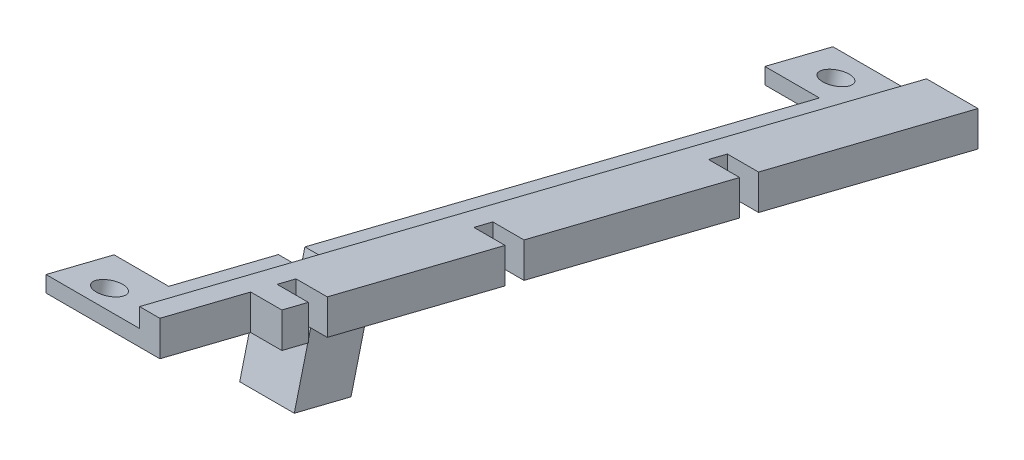
ISO-10303-21;
HEADER;
FILE_DESCRIPTION(('STEP AP214'),'2;1');
FILE_NAME('part.step','',(''),(''),'','','');
FILE_SCHEMA(('AUTOMOTIVE_DESIGN { 1 0 10303 214 1 1 1 1 }'));
ENDSEC;
DATA;
#1=APPLICATION_CONTEXT('core data for automotive mechanical design processes');
#2=APPLICATION_PROTOCOL_DEFINITION('international standard','automotive_design',2000,#1);
#3=PRODUCT_CONTEXT('',#1,'mechanical');
#4=PRODUCT('Part','Part','',(#3));
#5=PRODUCT_RELATED_PRODUCT_CATEGORY('part','',(#4));
#6=PRODUCT_DEFINITION_FORMATION('','',#4);
#7=PRODUCT_DEFINITION_CONTEXT('part definition',#1,'design');
#8=PRODUCT_DEFINITION('design','',#6,#7);
#9=PRODUCT_DEFINITION_SHAPE('','',#8);
#10=(LENGTH_UNIT() NAMED_UNIT(*) SI_UNIT(.MILLI.,.METRE.));
#11=(NAMED_UNIT(*) PLANE_ANGLE_UNIT() SI_UNIT($,.RADIAN.));
#12=(NAMED_UNIT(*) SI_UNIT($,.STERADIAN.) SOLID_ANGLE_UNIT());
#13=UNCERTAINTY_MEASURE_WITH_UNIT(LENGTH_MEASURE(1.E-05),#10,'distance_accuracy_value','');
#14=(GEOMETRIC_REPRESENTATION_CONTEXT(3) GLOBAL_UNCERTAINTY_ASSIGNED_CONTEXT((#13)) GLOBAL_UNIT_ASSIGNED_CONTEXT((#10,
#11,#12)) REPRESENTATION_CONTEXT('',''));
#15=CARTESIAN_POINT('',(0.,0.,0.));
#16=DIRECTION('',(0.,0.,1.));
#17=DIRECTION('',(1.,0.,0.));
#18=AXIS2_PLACEMENT_3D('',#15,#16,#17);
#19=CARTESIAN_POINT('',(4.,-4.23663208393258,1.05631101626826));
#20=DIRECTION('',(0.,0.970295726275996,-0.241921895599668));
#21=DIRECTION('',(0.,0.241921895599668,0.970295726275996));
#22=AXIS2_PLACEMENT_3D('',#19,#20,#21);
#23=PLANE('',#22);
#24=CARTESIAN_POINT('',(-9.85,-2.32302808125502,8.73135746454529));
#25=DIRECTION('',(0.,0.970295726275996,-0.241921895599668));
#26=DIRECTION('',(0.,0.241921895599668,0.970295726275996));
#27=AXIS2_PLACEMENT_3D('',#24,#25,#26);
#28=CIRCLE('',#27,1.75);
#29=CARTESIAN_POINT('',(-9.85,-1.8996647639556,10.4293749855283));
#30=VERTEX_POINT('',#29);
#31=EDGE_CURVE('E340',#30,#30,#28,.T.);
#32=ORIENTED_EDGE('',*,*,#31,.T.);
#33=EDGE_LOOP('',(#32));
#34=FACE_BOUND('',#33,.T.);
#35=CARTESIAN_POINT('',(-9.85,-25.5475300588232,-84.4170322579504));
#36=DIRECTION('',(0.,0.970295726275996,-0.241921895599668));
#37=DIRECTION('',(0.,0.241921895599668,0.970295726275996));
#38=AXIS2_PLACEMENT_3D('',#35,#36,#37);
#39=CIRCLE('',#38,1.75);
#40=CARTESIAN_POINT('',(-9.85,-25.1241667415238,-82.7190147369674));
#41=VERTEX_POINT('',#40);
#42=EDGE_CURVE('E347',#41,#41,#39,.T.);
#43=ORIENTED_EDGE('',*,*,#42,.T.);
#44=EDGE_LOOP('',(#43));
#45=FACE_BOUND('',#44,.T.);
#46=DIRECTION('',(1.,0.,0.));
#47=VECTOR('',#46,1.);
#48=CARTESIAN_POINT('',(-7.6,-8.49203641904656,-16.0111835554926));
#49=LINE('',#48,#47);
#50=CARTESIAN_POINT('',(-7.6,-8.49203641904656,-16.0111835554926));
#51=VERTEX_POINT('',#50);
#52=CARTESIAN_POINT('',(-0.6,-8.49203641904656,-16.0111835554926));
#53=VERTEX_POINT('',#52);
#54=EDGE_CURVE('E287',#51,#53,#49,.T.);
#55=ORIENTED_EDGE('',*,*,#54,.F.);
#56=DIRECTION('',(0.,0.241921895599668,0.970295726275996));
#57=VECTOR('',#56,1.);
#58=CARTESIAN_POINT('',(-7.6,-26.7568143951695,-89.2672068173917));
#59=LINE('',#58,#57);
#60=CARTESIAN_POINT('',(-7.6,-24.5795173347725,-80.5345452809077));
#61=VERTEX_POINT('',#60);
#62=EDGE_CURVE('E256',#61,#51,#59,.T.);
#63=ORIENTED_EDGE('',*,*,#62,.F.);
#64=DIRECTION('',(1.,0.,0.));
#65=VECTOR('',#64,1.);
#66=CARTESIAN_POINT('',(-14.6,-24.5795173347725,-80.5345452809077));
#67=LINE('',#66,#65);
#68=CARTESIAN_POINT('',(-14.6,-24.5795173347725,-80.5345452809077));
#69=VERTEX_POINT('',#68);
#70=EDGE_CURVE('E398',#69,#61,#67,.T.);
#71=ORIENTED_EDGE('',*,*,#70,.F.);
#72=DIRECTION('',(0.,0.241921895599668,0.970295726275996));
#73=VECTOR('',#72,1.);
#74=CARTESIAN_POINT('',(-14.6,-24.5795173347725,-80.5345452809077));
#75=LINE('',#74,#73);
#76=CARTESIAN_POINT('',(-14.6,-26.7568143951695,-89.2672068173917));
#77=VERTEX_POINT('',#76);
#78=EDGE_CURVE('E381',#77,#69,#75,.T.);
#79=ORIENTED_EDGE('',*,*,#78,.F.);
#80=DIRECTION('',(1.,0.,0.));
#81=VECTOR('',#80,1.);
#82=CARTESIAN_POINT('',(-2.6,-26.7568143951695,-89.2672068173917));
#83=LINE('',#82,#81);
#84=CARTESIAN_POINT('',(4.,-26.7568143951695,-89.2672068173917));
#85=VERTEX_POINT('',#84);
#86=EDGE_CURVE('E551',#77,#85,#83,.T.);
#87=ORIENTED_EDGE('',*,*,#86,.T.);
#88=DIRECTION('',(0.,-0.241921895599668,-0.970295726275996));
#89=VECTOR('',#88,1.);
#90=CARTESIAN_POINT('',(4.,-4.23663208393258,1.05631101626826));
#91=LINE('',#90,#89);
#92=CARTESIAN_POINT('',(4.,-19.7410794227791,-61.1286307553878));
#93=VERTEX_POINT('',#92);
#94=EDGE_CURVE('E427',#93,#85,#91,.T.);
#95=ORIENTED_EDGE('',*,*,#94,.F.);
#96=DIRECTION('',(-1.,0.,0.));
#97=VECTOR('',#96,1.);
#98=CARTESIAN_POINT('',(4.,-19.7410794227791,-61.1286307553878));
#99=LINE('',#98,#97);
#100=CARTESIAN_POINT('',(0.,-19.7410794227791,-61.1286307553878));
#101=VERTEX_POINT('',#100);
#102=EDGE_CURVE('E445',#93,#101,#99,.T.);
#103=ORIENTED_EDGE('',*,*,#102,.T.);
#104=DIRECTION('',(0.,0.241921895599668,0.970295726275996));
#105=VECTOR('',#104,1.);
#106=CARTESIAN_POINT('',(0.,-26.7568143951695,-89.2672068173917));
#107=LINE('',#106,#105);
#108=CARTESIAN_POINT('',(0.,-19.1362746837799,-58.7028914396978));
#109=VERTEX_POINT('',#108);
#110=EDGE_CURVE('E538',#101,#109,#107,.T.);
#111=ORIENTED_EDGE('',*,*,#110,.T.);
#112=DIRECTION('',(-1.,0.,0.));
#113=VECTOR('',#112,1.);
#114=CARTESIAN_POINT('',(4.,-19.1362746837799,-58.7028914396978));
#115=LINE('',#114,#113);
#116=CARTESIAN_POINT('',(4.,-19.1362746837799,-58.7028914396978));
#117=VERTEX_POINT('',#116);
#118=EDGE_CURVE('E476',#117,#109,#115,.T.);
#119=ORIENTED_EDGE('',*,*,#118,.F.);
#120=DIRECTION('',(0.,-0.241921895599668,-0.970295726275996));
#121=VECTOR('',#120,1.);
#122=CARTESIAN_POINT('',(4.,-4.23663208393258,1.05631101626826));
#123=LINE('',#122,#121);
#124=CARTESIAN_POINT('',(4.,-12.2415006591894,-31.0494632408319));
#125=VERTEX_POINT('',#124);
#126=EDGE_CURVE('E453',#125,#117,#123,.T.);
#127=ORIENTED_EDGE('',*,*,#126,.F.);
#128=DIRECTION('',(-1.,0.,0.));
#129=VECTOR('',#128,1.);
#130=CARTESIAN_POINT('',(4.,-12.2415006591894,-31.0494632408319));
#131=LINE('',#130,#129);
#132=CARTESIAN_POINT('',(0.,-12.2415006591894,-31.0494632408319));
#133=VERTEX_POINT('',#132);
#134=EDGE_CURVE('E480',#125,#133,#131,.T.);
#135=ORIENTED_EDGE('',*,*,#134,.T.);
#136=CARTESIAN_POINT('',(0.,-11.6366959201902,-28.6237239251419));
#137=VERTEX_POINT('',#136);
#138=EDGE_CURVE('E541',#133,#137,#107,.T.);
#139=ORIENTED_EDGE('',*,*,#138,.T.);
#140=DIRECTION('',(-1.,0.,0.));
#141=VECTOR('',#140,1.);
#142=CARTESIAN_POINT('',(4.,-11.6366959201902,-28.6237239251419));
#143=LINE('',#142,#141);
#144=CARTESIAN_POINT('',(4.,-11.6366959201902,-28.6237239251419));
#145=VERTEX_POINT('',#144);
#146=EDGE_CURVE('E511',#145,#137,#143,.T.);
#147=ORIENTED_EDGE('',*,*,#146,.F.);
#148=DIRECTION('',(0.,-0.241921895599668,-0.970295726275996));
#149=VECTOR('',#148,1.);
#150=CARTESIAN_POINT('',(4.,-4.23663208393258,1.05631101626826));
#151=LINE('',#150,#149);
#152=CARTESIAN_POINT('',(4.,-5.95153137359801,-5.82177435765599));
#153=VERTEX_POINT('',#152);
#154=EDGE_CURVE('E488',#153,#145,#151,.T.);
#155=ORIENTED_EDGE('',*,*,#154,.F.);
#156=DIRECTION('',(-1.,0.,0.));
#157=VECTOR('',#156,1.);
#158=CARTESIAN_POINT('',(4.,-5.95153137359801,-5.82177435765599));
#159=LINE('',#158,#157);
#160=CARTESIAN_POINT('',(0.,-5.95153137359801,-5.82177435765599));
#161=VERTEX_POINT('',#160);
#162=EDGE_CURVE('E515',#153,#161,#159,.T.);
#163=ORIENTED_EDGE('',*,*,#162,.T.);
#164=CARTESIAN_POINT('',(0.,-5.34672663459884,-3.39603504196599));
#165=VERTEX_POINT('',#164);
#166=EDGE_CURVE('E600',#161,#165,#107,.T.);
#167=ORIENTED_EDGE('',*,*,#166,.T.);
#168=DIRECTION('',(-1.,0.,0.));
#169=VECTOR('',#168,1.);
#170=CARTESIAN_POINT('',(4.,-5.34672663459884,-3.39603504196599));
#171=LINE('',#170,#169);
#172=CARTESIAN_POINT('',(4.,-5.34672663459884,-3.39603504196599));
#173=VERTEX_POINT('',#172);
#174=EDGE_CURVE('E11',#173,#165,#171,.T.);
#175=ORIENTED_EDGE('',*,*,#174,.F.);
#176=DIRECTION('',(0.,-0.241921895599668,-0.970295726275996));
#177=VECTOR('',#176,1.);
#178=CARTESIAN_POINT('',(4.,-4.23663208393258,1.05631101626826));
#179=LINE('',#178,#177);
#180=CARTESIAN_POINT('',(4.,-4.5,0.));
#181=VERTEX_POINT('',#180);
#182=EDGE_CURVE('E558',#181,#173,#179,.T.);
#183=ORIENTED_EDGE('',*,*,#182,.F.);
#184=DIRECTION('',(-1.,0.,0.));
#185=VECTOR('',#184,1.);
#186=CARTESIAN_POINT('',(4.,-4.5,0.));
#187=LINE('',#186,#185);
#188=CARTESIAN_POINT('',(0.,-4.5,0.));
#189=VERTEX_POINT('',#188);
#190=EDGE_CURVE('E573',#181,#189,#187,.T.);
#191=ORIENTED_EDGE('',*,*,#190,.T.);
#192=CARTESIAN_POINT('',(0.,-1.59693725280398,11.643548715312));
#193=VERTEX_POINT('',#192);
#194=EDGE_CURVE('E536',#189,#193,#107,.T.);
#195=ORIENTED_EDGE('',*,*,#194,.T.);
#196=DIRECTION('',(1.,0.,0.));
#197=VECTOR('',#196,1.);
#198=CARTESIAN_POINT('',(-2.6,-1.59693725280398,11.643548715312));
#199=LINE('',#198,#197);
#200=CARTESIAN_POINT('',(-14.6,-1.59693725280398,11.643548715312));
#201=VERTEX_POINT('',#200);
#202=EDGE_CURVE('E547',#201,#193,#199,.T.);
#203=ORIENTED_EDGE('',*,*,#202,.F.);
#204=DIRECTION('',(0.,0.241921895599669,0.970295726275996));
#205=VECTOR('',#204,1.);
#206=CARTESIAN_POINT('',(-14.6,-1.59693725280398,11.643548715312));
#207=LINE('',#206,#205);
#208=CARTESIAN_POINT('',(-14.6,-3.774234313201,2.91088717882799));
#209=VERTEX_POINT('',#208);
#210=EDGE_CURVE('E358',#209,#201,#207,.T.);
#211=ORIENTED_EDGE('',*,*,#210,.F.);
#212=DIRECTION('',(1.,0.,0.));
#213=VECTOR('',#212,1.);
#214=CARTESIAN_POINT('',(-14.6,-3.774234313201,2.91088717882799));
#215=LINE('',#214,#213);
#216=CARTESIAN_POINT('',(-7.6,-3.774234313201,2.91088717882798));
#217=VERTEX_POINT('',#216);
#218=EDGE_CURVE('E366',#209,#217,#215,.T.);
#219=ORIENTED_EDGE('',*,*,#218,.T.);
#220=CARTESIAN_POINT('',(-7.6,-6.67762220204905,-8.73396560842266));
#221=VERTEX_POINT('',#220);
#222=EDGE_CURVE('E406',#221,#217,#59,.T.);
#223=ORIENTED_EDGE('',*,*,#222,.F.);
#224=DIRECTION('',(-1.,0.,0.));
#225=VECTOR('',#224,1.);
#226=CARTESIAN_POINT('',(-0.6,-6.67762220204905,-8.73396560842266));
#227=LINE('',#226,#225);
#228=CARTESIAN_POINT('',(-0.6,-6.67762220204905,-8.73396560842266));
#229=VERTEX_POINT('',#228);
#230=EDGE_CURVE('E294',#229,#221,#227,.T.);
#231=ORIENTED_EDGE('',*,*,#230,.F.);
#232=DIRECTION('',(0.,0.241921895599668,0.970295726275996));
#233=VECTOR('',#232,1.);
#234=CARTESIAN_POINT('',(-0.6,-6.67762220204905,-8.73396560842266));
#235=LINE('',#234,#233);
#236=EDGE_CURVE('E305',#53,#229,#235,.T.);
#237=ORIENTED_EDGE('',*,*,#236,.F.);
#238=EDGE_LOOP('',(#55,#63,#71,#79,#87,#95,#103,#111,#119,#127,#135,#139,#147,#155,#163,#167,
#175,#183,#191,#195,#203,#211,#219,#223,#231,#237));
#239=FACE_BOUND('',#238,.T.);
#240=ADVANCED_FACE('F39',(#34,#45,#239),#23,.F.);
#241=CARTESIAN_POINT('',(-7.6,-24.6955871364697,-89.2672068173917));
#242=DIRECTION('',(0.,-0.970295726275996,0.241921895599668));
#243=DIRECTION('',(0.,-0.241921895599668,-0.970295726275996));
#244=AXIS2_PLACEMENT_3D('',#241,#242,#243);
#245=PLANE('',#244);
#246=CARTESIAN_POINT('',(-9.85,-0.382436628703028,8.24751367334595));
#247=DIRECTION('',(0.,0.970295726275996,-0.241921895599668));
#248=DIRECTION('',(0.,0.241921895599668,0.970295726275996));
#249=AXIS2_PLACEMENT_3D('',#246,#247,#248);
#250=CIRCLE('',#249,1.75);
#251=CARTESIAN_POINT('',(-9.85,0.0409266885963917,9.94553119432895));
#252=VERTEX_POINT('',#251);
#253=EDGE_CURVE('E328',#252,#252,#250,.T.);
#254=ORIENTED_EDGE('',*,*,#253,.F.);
#255=EDGE_LOOP('',(#254));
#256=FACE_BOUND('',#255,.T.);
#257=DIRECTION('',(0.,-0.241921895599668,-0.970295726275996));
#258=VECTOR('',#257,1.);
#259=CARTESIAN_POINT('',(-2.6,-24.6955871364697,-89.2672068173917));
#260=LINE('',#259,#258);
#261=CARTESIAN_POINT('',(-2.6,0.464290005895813,11.643548715312));
#262=VERTEX_POINT('',#261);
#263=CARTESIAN_POINT('',(-2.6,-5.2208745406964,-11.158400852174));
#264=VERTEX_POINT('',#263);
#265=EDGE_CURVE('E411',#262,#264,#260,.T.);
#266=ORIENTED_EDGE('',*,*,#265,.T.);
#267=DIRECTION('',(-1.,0.,0.));
#268=VECTOR('',#267,1.);
#269=CARTESIAN_POINT('',(-2.6,-5.2208745406964,-11.158400852174));
#270=LINE('',#269,#268);
#271=CARTESIAN_POINT('',(-7.6,-5.2208745406964,-11.158400852174));
#272=VERTEX_POINT('',#271);
#273=EDGE_CURVE('E260',#264,#272,#270,.T.);
#274=ORIENTED_EDGE('',*,*,#273,.T.);
#275=DIRECTION('',(0.,-0.241921895599668,-0.970295726275996));
#276=VECTOR('',#275,1.);
#277=CARTESIAN_POINT('',(-7.6,-24.6955871364697,-89.2672068173917));
#278=LINE('',#277,#276);
#279=CARTESIAN_POINT('',(-7.6,-1.7130070545012,2.91088717882799));
#280=VERTEX_POINT('',#279);
#281=EDGE_CURVE('E407',#280,#272,#278,.T.);
#282=ORIENTED_EDGE('',*,*,#281,.F.);
#283=DIRECTION('',(1.,0.,0.));
#284=VECTOR('',#283,1.);
#285=CARTESIAN_POINT('',(-14.6,-1.7130070545012,2.91088717882799));
#286=LINE('',#285,#284);
#287=CARTESIAN_POINT('',(-14.6,-1.7130070545012,2.91088717882799));
#288=VERTEX_POINT('',#287);
#289=EDGE_CURVE('E372',#288,#280,#286,.T.);
#290=ORIENTED_EDGE('',*,*,#289,.F.);
#291=DIRECTION('',(0.,-0.241921895599668,-0.970295726275996));
#292=VECTOR('',#291,1.);
#293=CARTESIAN_POINT('',(-14.6,-1.7130070545012,2.91088717882799));
#294=LINE('',#293,#292);
#295=CARTESIAN_POINT('',(-14.6,0.464290005895813,11.643548715312));
#296=VERTEX_POINT('',#295);
#297=EDGE_CURVE('E351',#296,#288,#294,.T.);
#298=ORIENTED_EDGE('',*,*,#297,.F.);
#299=DIRECTION('',(1.,0.,0.));
#300=VECTOR('',#299,1.);
#301=CARTESIAN_POINT('',(-7.6,0.464290005895813,11.643548715312));
#302=LINE('',#301,#300);
#303=EDGE_CURVE('E418',#296,#262,#302,.T.);
#304=ORIENTED_EDGE('',*,*,#303,.T.);
#305=EDGE_LOOP('',(#266,#274,#282,#290,#298,#304));
#306=FACE_BOUND('',#305,.T.);
#307=ADVANCED_FACE('F658',(#256,#306),#245,.F.);
#308=CARTESIAN_POINT('',(-7.6,0.,0.));
#309=DIRECTION('',(-1.,0.,0.));
#310=DIRECTION('',(0.,0.,1.));
#311=AXIS2_PLACEMENT_3D('',#308,#309,#310);
#312=PLANE('',#311);
#313=DIRECTION('',(0.,-0.970295726275996,0.241921895599668));
#314=VECTOR('',#313,1.);
#315=CARTESIAN_POINT('',(-7.6,-6.06760117529524,-14.55443589414));
#316=LINE('',#315,#314);
#317=CARTESIAN_POINT('',(-7.6,-6.06760117529524,-14.55443589414));
#318=VERTEX_POINT('',#317);
#319=CARTESIAN_POINT('',(-7.6,-16.2557063011932,-12.0142559903435));
#320=VERTEX_POINT('',#319);
#321=EDGE_CURVE('E331',#318,#320,#316,.T.);
#322=ORIENTED_EDGE('',*,*,#321,.F.);
#323=CARTESIAN_POINT('',(-7.6,-22.5182900760727,-80.5345452809077));
#324=VERTEX_POINT('',#323);
#325=EDGE_CURVE('E405',#318,#324,#278,.T.);
#326=ORIENTED_EDGE('',*,*,#325,.T.);
#327=DIRECTION('',(0.,1.,0.));
#328=VECTOR('',#327,1.);
#329=CARTESIAN_POINT('',(-7.6,-22.5182900760727,-80.5345452809077));
#330=LINE('',#329,#328);
#331=EDGE_CURVE('E376',#61,#324,#330,.T.);
#332=ORIENTED_EDGE('',*,*,#331,.F.);
#333=ORIENTED_EDGE('',*,*,#62,.T.);
#334=DIRECTION('',(0.,0.970295726275996,-0.241921895599668));
#335=VECTOR('',#334,1.);
#336=CARTESIAN_POINT('',(-7.6,-16.7395500923925,-13.9548474428954));
#337=LINE('',#336,#335);
#338=CARTESIAN_POINT('',(-7.6,-18.6801415449445,-13.4710036516961));
#339=VERTEX_POINT('',#338);
#340=EDGE_CURVE('E248',#339,#51,#337,.T.);
#341=ORIENTED_EDGE('',*,*,#340,.F.);
#342=DIRECTION('',(0.,-0.241921895599669,-0.970295726275996));
#343=VECTOR('',#342,1.);
#344=CARTESIAN_POINT('',(-7.6,-16.865727327947,-6.19378570462615));
#345=LINE('',#344,#343);
#346=CARTESIAN_POINT('',(-7.6,-16.865727327947,-6.19378570462615));
#347=VERTEX_POINT('',#346);
#348=EDGE_CURVE('E254',#347,#339,#345,.T.);
#349=ORIENTED_EDGE('',*,*,#348,.F.);
#350=DIRECTION('',(0.,0.970295726275996,-0.241921895599668));
#351=VECTOR('',#350,1.);
#352=CARTESIAN_POINT('',(-7.6,-14.925135875395,-6.67762949582548));
#353=LINE('',#352,#351);
#354=EDGE_CURVE('E302',#347,#221,#353,.T.);
#355=ORIENTED_EDGE('',*,*,#354,.T.);
#356=ORIENTED_EDGE('',*,*,#222,.T.);
#357=DIRECTION('',(0.,-1.,0.));
#358=VECTOR('',#357,1.);
#359=CARTESIAN_POINT('',(-7.6,-3.774234313201,2.91088717882799));
#360=LINE('',#359,#358);
#361=EDGE_CURVE('E62',#280,#217,#360,.T.);
#362=ORIENTED_EDGE('',*,*,#361,.F.);
#363=ORIENTED_EDGE('',*,*,#281,.T.);
#364=DIRECTION('',(0.,-0.970295726275996,0.241921895599668));
#365=VECTOR('',#364,1.);
#366=CARTESIAN_POINT('',(-7.6,-5.2208745406964,-11.158400852174));
#367=LINE('',#366,#365);
#368=CARTESIAN_POINT('',(-7.6,-15.4089796665944,-8.61822094837747));
#369=VERTEX_POINT('',#368);
#370=EDGE_CURVE('E324',#272,#369,#367,.T.);
#371=ORIENTED_EDGE('',*,*,#370,.T.);
#372=DIRECTION('',(0.,-0.241921895599669,-0.970295726275996));
#373=VECTOR('',#372,1.);
#374=CARTESIAN_POINT('',(-7.6,-14.925135875395,-6.67762949582548));
#375=LINE('',#374,#373);
#376=EDGE_CURVE('E278',#369,#320,#375,.T.);
#377=ORIENTED_EDGE('',*,*,#376,.T.);
#378=EDGE_LOOP('',(#322,#326,#332,#333,#341,#349,#355,#356,#362,#363,#371,#377));
#379=FACE_BOUND('',#378,.T.);
#380=ADVANCED_FACE('F251',(#379),#312,.T.);
#381=CARTESIAN_POINT('',(-2.6,0.,0.));
#382=DIRECTION('',(1.,0.,0.));
#383=DIRECTION('',(0.,0.,-1.));
#384=AXIS2_PLACEMENT_3D('',#381,#382,#383);
#385=PLANE('',#384);
#386=ORIENTED_EDGE('',*,*,#265,.F.);
#387=DIRECTION('',(0.,1.,0.));
#388=VECTOR('',#387,1.);
#389=CARTESIAN_POINT('',(-2.6,2.90306274719602,11.643548715312));
#390=LINE('',#389,#388);
#391=CARTESIAN_POINT('',(-2.6,2.90306274719602,11.643548715312));
#392=VERTEX_POINT('',#391);
#393=EDGE_CURVE('E528',#262,#392,#390,.T.);
#394=ORIENTED_EDGE('',*,*,#393,.T.);
#395=DIRECTION('',(0.,-0.241921895599668,-0.970295726275996));
#396=VECTOR('',#395,1.);
#397=CARTESIAN_POINT('',(-2.6,-22.2568143951695,-89.2672068173917));
#398=LINE('',#397,#396);
#399=CARTESIAN_POINT('',(-2.6,-22.2568143951695,-89.2672068173917));
#400=VERTEX_POINT('',#399);
#401=EDGE_CURVE('E519',#392,#400,#398,.T.);
#402=ORIENTED_EDGE('',*,*,#401,.T.);
#403=DIRECTION('',(0.,-1.,0.));
#404=VECTOR('',#403,1.);
#405=CARTESIAN_POINT('',(-2.6,-22.2568143951695,-89.2672068173917));
#406=LINE('',#405,#404);
#407=CARTESIAN_POINT('',(-2.6,-24.6955871364697,-89.2672068173917));
#408=VERTEX_POINT('',#407);
#409=EDGE_CURVE('E523',#400,#408,#406,.T.);
#410=ORIENTED_EDGE('',*,*,#409,.T.);
#411=CARTESIAN_POINT('',(-2.6,-6.06760117529523,-14.55443589414));
#412=VERTEX_POINT('',#411);
#413=EDGE_CURVE('E402',#412,#408,#260,.T.);
#414=ORIENTED_EDGE('',*,*,#413,.F.);
#415=DIRECTION('',(0.,-0.970295726275996,0.241921895599668));
#416=VECTOR('',#415,1.);
#417=CARTESIAN_POINT('',(-2.6,-6.06760117529524,-14.55443589414));
#418=LINE('',#417,#416);
#419=CARTESIAN_POINT('',(-2.6,-16.2557063011932,-12.0142559903435));
#420=VERTEX_POINT('',#419);
#421=EDGE_CURVE('E54',#412,#420,#418,.T.);
#422=ORIENTED_EDGE('',*,*,#421,.T.);
#423=DIRECTION('',(0.,-0.241921895599668,-0.970295726275996));
#424=VECTOR('',#423,1.);
#425=CARTESIAN_POINT('',(-2.6,-16.2557063011932,-12.0142559903435));
#426=LINE('',#425,#424);
#427=CARTESIAN_POINT('',(-2.6,-15.4089796665944,-8.61822094837747));
#428=VERTEX_POINT('',#427);
#429=EDGE_CURVE('E289',#428,#420,#426,.T.);
#430=ORIENTED_EDGE('',*,*,#429,.F.);
#431=DIRECTION('',(0.,-0.970295726275996,0.241921895599668));
#432=VECTOR('',#431,1.);
#433=CARTESIAN_POINT('',(-2.6,-5.2208745406964,-11.158400852174));
#434=LINE('',#433,#432);
#435=EDGE_CURVE('E325',#264,#428,#434,.T.);
#436=ORIENTED_EDGE('',*,*,#435,.F.);
#437=EDGE_LOOP('',(#386,#394,#402,#410,#414,#422,#430,#436));
#438=FACE_BOUND('',#437,.T.);
#439=ADVANCED_FACE('F631',(#438),#385,.F.);
#440=CARTESIAN_POINT('',(0.,0.,0.));
#441=DIRECTION('',(1.,0.,0.));
#442=DIRECTION('',(0.,0.,-1.));
#443=AXIS2_PLACEMENT_3D('',#440,#441,#442);
#444=PLANE('',#443);
#445=DIRECTION('',(0.,1.,0.));
#446=VECTOR('',#445,1.);
#447=CARTESIAN_POINT('',(0.,0.,-61.1286307553878));
#448=LINE('',#447,#446);
#449=CARTESIAN_POINT('',(0.,-15.2410794227791,-61.1286307553878));
#450=VERTEX_POINT('',#449);
#451=EDGE_CURVE('E422',#101,#450,#448,.T.);
#452=ORIENTED_EDGE('',*,*,#451,.T.);
#453=DIRECTION('',(0.,-0.241921895599668,-0.970295726275996));
#454=VECTOR('',#453,1.);
#455=CARTESIAN_POINT('',(0.,-22.2568143951695,-89.2672068173917));
#456=LINE('',#455,#454);
#457=CARTESIAN_POINT('',(0.,-14.6362746837799,-58.7028914396978));
#458=VERTEX_POINT('',#457);
#459=EDGE_CURVE('E518',#458,#450,#456,.T.);
#460=ORIENTED_EDGE('',*,*,#459,.F.);
#461=DIRECTION('',(0.,1.,0.));
#462=VECTOR('',#461,1.);
#463=CARTESIAN_POINT('',(0.,0.,-58.7028914396978));
#464=LINE('',#463,#462);
#465=EDGE_CURVE('E454',#109,#458,#464,.T.);
#466=ORIENTED_EDGE('',*,*,#465,.F.);
#467=ORIENTED_EDGE('',*,*,#110,.F.);
#468=EDGE_LOOP('',(#452,#460,#466,#467));
#469=FACE_BOUND('',#468,.T.);
#470=ADVANCED_FACE('F613',(#469),#444,.T.);
#471=DIRECTION('',(0.,1.,0.));
#472=VECTOR('',#471,1.);
#473=CARTESIAN_POINT('',(0.,0.,-31.0494632408319));
#474=LINE('',#473,#472);
#475=CARTESIAN_POINT('',(0.,-7.74150065918938,-31.0494632408319));
#476=VERTEX_POINT('',#475);
#477=EDGE_CURVE('E448',#133,#476,#474,.T.);
#478=ORIENTED_EDGE('',*,*,#477,.T.);
#479=CARTESIAN_POINT('',(0.,-7.13669592019021,-28.6237239251419));
#480=VERTEX_POINT('',#479);
#481=EDGE_CURVE('E603',#480,#476,#456,.T.);
#482=ORIENTED_EDGE('',*,*,#481,.F.);
#483=DIRECTION('',(0.,1.,0.));
#484=VECTOR('',#483,1.);
#485=CARTESIAN_POINT('',(0.,0.,-28.6237239251419));
#486=LINE('',#485,#484);
#487=EDGE_CURVE('E489',#137,#480,#486,.T.);
#488=ORIENTED_EDGE('',*,*,#487,.F.);
#489=ORIENTED_EDGE('',*,*,#138,.F.);
#490=EDGE_LOOP('',(#478,#482,#488,#489));
#491=FACE_BOUND('',#490,.T.);
#492=ADVANCED_FACE('F742',(#491),#444,.T.);
#493=CARTESIAN_POINT('',(4.,0.,-3.39603504196599));
#494=DIRECTION('',(0.,0.,1.));
#495=DIRECTION('',(1.,0.,0.));
#496=AXIS2_PLACEMENT_3D('',#493,#494,#495);
#497=PLANE('',#496);
#498=DIRECTION('',(0.,1.,0.));
#499=VECTOR('',#498,1.);
#500=CARTESIAN_POINT('',(0.,0.,-3.39603504196599));
#501=LINE('',#500,#499);
#502=CARTESIAN_POINT('',(0.,-0.84672663459884,-3.39603504196599));
#503=VERTEX_POINT('',#502);
#504=EDGE_CURVE('E557',#165,#503,#501,.T.);
#505=ORIENTED_EDGE('',*,*,#504,.T.);
#506=DIRECTION('',(-1.,0.,0.));
#507=VECTOR('',#506,1.);
#508=CARTESIAN_POINT('',(4.,-0.84672663459884,-3.39603504196599));
#509=LINE('',#508,#507);
#510=CARTESIAN_POINT('',(4.,-0.84672663459884,-3.39603504196599));
#511=VERTEX_POINT('',#510);
#512=EDGE_CURVE('E47',#511,#503,#509,.T.);
#513=ORIENTED_EDGE('',*,*,#512,.F.);
#514=DIRECTION('',(0.,1.,0.));
#515=VECTOR('',#514,1.);
#516=CARTESIAN_POINT('',(4.,0.,-3.39603504196599));
#517=LINE('',#516,#515);
#518=EDGE_CURVE('E562',#173,#511,#517,.T.);
#519=ORIENTED_EDGE('',*,*,#518,.F.);
#520=ORIENTED_EDGE('',*,*,#174,.T.);
#521=EDGE_LOOP('',(#505,#513,#519,#520));
#522=FACE_BOUND('',#521,.T.);
#523=ADVANCED_FACE('F595',(#522),#497,.F.);
#524=CARTESIAN_POINT('',(4.,0.,0.));
#525=DIRECTION('',(0.,0.970295726275996,-0.241921895599668));
#526=DIRECTION('',(0.,0.241921895599668,0.970295726275996));
#527=AXIS2_PLACEMENT_3D('',#524,#525,#526);
#528=PLANE('',#527);
#529=ORIENTED_EDGE('',*,*,#512,.T.);
#530=CARTESIAN_POINT('',(0.,-1.45153137359801,-5.82177435765598));
#531=VERTEX_POINT('',#530);
#532=EDGE_CURVE('E537',#503,#531,#456,.T.);
#533=ORIENTED_EDGE('',*,*,#532,.T.);
#534=DIRECTION('',(-1.,0.,0.));
#535=VECTOR('',#534,1.);
#536=CARTESIAN_POINT('',(4.,-1.45153137359801,-5.82177435765598));
#537=LINE('',#536,#535);
#538=CARTESIAN_POINT('',(4.,-1.45153137359801,-5.82177435765598));
#539=VERTEX_POINT('',#538);
#540=EDGE_CURVE('E499',#539,#531,#537,.T.);
#541=ORIENTED_EDGE('',*,*,#540,.F.);
#542=DIRECTION('',(0.,-0.241921895599668,-0.970295726275996));
#543=VECTOR('',#542,1.);
#544=CARTESIAN_POINT('',(4.,0.,0.));
#545=LINE('',#544,#543);
#546=CARTESIAN_POINT('',(4.,-7.13669592019021,-28.6237239251419));
#547=VERTEX_POINT('',#546);
#548=EDGE_CURVE('E495',#539,#547,#545,.T.);
#549=ORIENTED_EDGE('',*,*,#548,.T.);
#550=DIRECTION('',(-1.,0.,0.));
#551=VECTOR('',#550,1.);
#552=CARTESIAN_POINT('',(4.,-7.13669592019021,-28.6237239251419));
#553=LINE('',#552,#551);
#554=EDGE_CURVE('E507',#547,#480,#553,.T.);
#555=ORIENTED_EDGE('',*,*,#554,.T.);
#556=ORIENTED_EDGE('',*,*,#481,.T.);
#557=DIRECTION('',(-1.,0.,0.));
#558=VECTOR('',#557,1.);
#559=CARTESIAN_POINT('',(4.,-7.74150065918938,-31.0494632408319));
#560=LINE('',#559,#558);
#561=CARTESIAN_POINT('',(4.,-7.74150065918938,-31.0494632408319));
#562=VERTEX_POINT('',#561);
#563=EDGE_CURVE('E464',#562,#476,#560,.T.);
#564=ORIENTED_EDGE('',*,*,#563,.F.);
#565=DIRECTION('',(0.,-0.241921895599668,-0.970295726275996));
#566=VECTOR('',#565,1.);
#567=CARTESIAN_POINT('',(4.,0.,0.));
#568=LINE('',#567,#566);
#569=CARTESIAN_POINT('',(4.,-14.6362746837799,-58.7028914396978));
#570=VERTEX_POINT('',#569);
#571=EDGE_CURVE('E460',#562,#570,#568,.T.);
#572=ORIENTED_EDGE('',*,*,#571,.T.);
#573=DIRECTION('',(-1.,0.,0.));
#574=VECTOR('',#573,1.);
#575=CARTESIAN_POINT('',(4.,-14.6362746837799,-58.7028914396978));
#576=LINE('',#575,#574);
#577=EDGE_CURVE('E472',#570,#458,#576,.T.);
#578=ORIENTED_EDGE('',*,*,#577,.T.);
#579=ORIENTED_EDGE('',*,*,#459,.T.);
#580=DIRECTION('',(-1.,0.,0.));
#581=VECTOR('',#580,1.);
#582=CARTESIAN_POINT('',(4.,-15.2410794227791,-61.1286307553878));
#583=LINE('',#582,#581);
#584=CARTESIAN_POINT('',(4.,-15.2410794227791,-61.1286307553878));
#585=VERTEX_POINT('',#584);
#586=EDGE_CURVE('E439',#585,#450,#583,.T.);
#587=ORIENTED_EDGE('',*,*,#586,.F.);
#588=DIRECTION('',(0.,-0.241921895599668,-0.970295726275996));
#589=VECTOR('',#588,1.);
#590=CARTESIAN_POINT('',(4.,0.,0.));
#591=LINE('',#590,#589);
#592=CARTESIAN_POINT('',(4.,-22.2568143951695,-89.2672068173917));
#593=VERTEX_POINT('',#592);
#594=EDGE_CURVE('E435',#585,#593,#591,.T.);
#595=ORIENTED_EDGE('',*,*,#594,.T.);
#596=DIRECTION('',(1.,0.,0.));
#597=VECTOR('',#596,1.);
#598=CARTESIAN_POINT('',(-2.6,-22.2568143951695,-89.2672068173917));
#599=LINE('',#598,#597);
#600=EDGE_CURVE('E554',#400,#593,#599,.T.);
#601=ORIENTED_EDGE('',*,*,#600,.F.);
#602=ORIENTED_EDGE('',*,*,#401,.F.);
#603=DIRECTION('',(1.,0.,0.));
#604=VECTOR('',#603,1.);
#605=CARTESIAN_POINT('',(-2.6,2.90306274719602,11.643548715312));
#606=LINE('',#605,#604);
#607=CARTESIAN_POINT('',(0.,2.90306274719602,11.643548715312));
#608=VERTEX_POINT('',#607);
#609=EDGE_CURVE('E531',#392,#608,#606,.T.);
#610=ORIENTED_EDGE('',*,*,#609,.T.);
#611=CARTESIAN_POINT('',(0.,0.,0.));
#612=VERTEX_POINT('',#611);
#613=EDGE_CURVE('E532',#608,#612,#456,.T.);
#614=ORIENTED_EDGE('',*,*,#613,.T.);
#615=DIRECTION('',(-1.,0.,0.));
#616=VECTOR('',#615,1.);
#617=CARTESIAN_POINT('',(4.,0.,0.));
#618=LINE('',#617,#616);
#619=CARTESIAN_POINT('',(4.,0.,0.));
#620=VERTEX_POINT('',#619);
#621=EDGE_CURVE('E583',#620,#612,#618,.T.);
#622=ORIENTED_EDGE('',*,*,#621,.F.);
#623=DIRECTION('',(0.,-0.241921895599668,-0.970295726275996));
#624=VECTOR('',#623,1.);
#625=CARTESIAN_POINT('',(4.,0.,0.));
#626=LINE('',#625,#624);
#627=EDGE_CURVE('E566',#620,#511,#626,.T.);
#628=ORIENTED_EDGE('',*,*,#627,.T.);
#629=EDGE_LOOP('',(#529,#533,#541,#549,#555,#556,#564,#572,#578,#579,#587,#595,#601,#602,#610,
#614,#622,#628));
#630=FACE_BOUND('',#629,.T.);
#631=ADVANCED_FACE('F591',(#630),#528,.T.);
#632=CARTESIAN_POINT('',(4.,0.,0.));
#633=DIRECTION('',(0.,0.,-1.));
#634=DIRECTION('',(-1.,0.,0.));
#635=AXIS2_PLACEMENT_3D('',#632,#633,#634);
#636=PLANE('',#635);
#637=DIRECTION('',(0.,-1.,0.));
#638=VECTOR('',#637,1.);
#639=CARTESIAN_POINT('',(0.,0.,0.));
#640=LINE('',#639,#638);
#641=EDGE_CURVE('E563',#612,#189,#640,.T.);
#642=ORIENTED_EDGE('',*,*,#641,.T.);
#643=ORIENTED_EDGE('',*,*,#190,.F.);
#644=DIRECTION('',(0.,-1.,0.));
#645=VECTOR('',#644,1.);
#646=CARTESIAN_POINT('',(4.,0.,0.));
#647=LINE('',#646,#645);
#648=EDGE_CURVE('E570',#620,#181,#647,.T.);
#649=ORIENTED_EDGE('',*,*,#648,.F.);
#650=ORIENTED_EDGE('',*,*,#621,.T.);
#651=EDGE_LOOP('',(#642,#643,#649,#650));
#652=FACE_BOUND('',#651,.T.);
#653=ADVANCED_FACE('F642',(#652),#636,.F.);
#654=CARTESIAN_POINT('',(4.,0.,0.));
#655=DIRECTION('',(1.,0.,0.));
#656=DIRECTION('',(0.,0.,-1.));
#657=AXIS2_PLACEMENT_3D('',#654,#655,#656);
#658=PLANE('',#657);
#659=ORIENTED_EDGE('',*,*,#182,.T.);
#660=ORIENTED_EDGE('',*,*,#518,.T.);
#661=ORIENTED_EDGE('',*,*,#627,.F.);
#662=ORIENTED_EDGE('',*,*,#648,.T.);
#663=EDGE_LOOP('',(#659,#660,#661,#662));
#664=FACE_BOUND('',#663,.T.);
#665=ADVANCED_FACE('F647',(#664),#658,.T.);
#666=ORIENTED_EDGE('',*,*,#641,.F.);
#667=ORIENTED_EDGE('',*,*,#613,.F.);
#668=DIRECTION('',(0.,1.,0.));
#669=VECTOR('',#668,1.);
#670=CARTESIAN_POINT('',(0.,2.90306274719602,11.643548715312));
#671=LINE('',#670,#669);
#672=EDGE_CURVE('E524',#193,#608,#671,.T.);
#673=ORIENTED_EDGE('',*,*,#672,.F.);
#674=ORIENTED_EDGE('',*,*,#194,.F.);
#675=EDGE_LOOP('',(#666,#667,#673,#674));
#676=FACE_BOUND('',#675,.T.);
#677=ADVANCED_FACE('F639',(#676),#444,.T.);
#678=DIRECTION('',(0.,1.,0.));
#679=VECTOR('',#678,1.);
#680=CARTESIAN_POINT('',(0.,0.,-5.82177435765597));
#681=LINE('',#680,#679);
#682=EDGE_CURVE('E483',#161,#531,#681,.T.);
#683=ORIENTED_EDGE('',*,*,#682,.T.);
#684=ORIENTED_EDGE('',*,*,#532,.F.);
#685=ORIENTED_EDGE('',*,*,#504,.F.);
#686=ORIENTED_EDGE('',*,*,#166,.F.);
#687=EDGE_LOOP('',(#683,#684,#685,#686));
#688=FACE_BOUND('',#687,.T.);
#689=ADVANCED_FACE('F599',(#688),#444,.T.);
#690=CARTESIAN_POINT('',(-2.6,-22.2568143951695,-89.2672068173917));
#691=DIRECTION('',(0.,0.,1.));
#692=DIRECTION('',(1.,0.,0.));
#693=AXIS2_PLACEMENT_3D('',#690,#691,#692);
#694=PLANE('',#693);
#695=ORIENTED_EDGE('',*,*,#600,.T.);
#696=DIRECTION('',(0.,1.,0.));
#697=VECTOR('',#696,1.);
#698=CARTESIAN_POINT('',(4.,0.,-89.2672068173917));
#699=LINE('',#698,#697);
#700=EDGE_CURVE('E431',#85,#593,#699,.T.);
#701=ORIENTED_EDGE('',*,*,#700,.F.);
#702=ORIENTED_EDGE('',*,*,#86,.F.);
#703=DIRECTION('',(0.,-1.,0.));
#704=VECTOR('',#703,1.);
#705=CARTESIAN_POINT('',(-14.6,-26.7568143951695,-89.2672068173917));
#706=LINE('',#705,#704);
#707=CARTESIAN_POINT('',(-14.6,-24.6955871364697,-89.2672068173917));
#708=VERTEX_POINT('',#707);
#709=EDGE_CURVE('E377',#708,#77,#706,.T.);
#710=ORIENTED_EDGE('',*,*,#709,.F.);
#711=DIRECTION('',(1.,0.,0.));
#712=VECTOR('',#711,1.);
#713=CARTESIAN_POINT('',(-7.6,-24.6955871364697,-89.2672068173917));
#714=LINE('',#713,#712);
#715=EDGE_CURVE('E410',#708,#408,#714,.T.);
#716=ORIENTED_EDGE('',*,*,#715,.T.);
#717=ORIENTED_EDGE('',*,*,#409,.F.);
#718=EDGE_LOOP('',(#695,#701,#702,#710,#716,#717));
#719=FACE_BOUND('',#718,.T.);
#720=ADVANCED_FACE('F627',(#719),#694,.F.);
#721=CARTESIAN_POINT('',(-2.6,2.90306274719602,11.643548715312));
#722=DIRECTION('',(0.,0.,-1.));
#723=DIRECTION('',(0.,1.,0.));
#724=AXIS2_PLACEMENT_3D('',#721,#722,#723);
#725=PLANE('',#724);
#726=ORIENTED_EDGE('',*,*,#672,.T.);
#727=ORIENTED_EDGE('',*,*,#609,.F.);
#728=ORIENTED_EDGE('',*,*,#393,.F.);
#729=ORIENTED_EDGE('',*,*,#303,.F.);
#730=DIRECTION('',(0.,1.,0.));
#731=VECTOR('',#730,1.);
#732=CARTESIAN_POINT('',(-14.6,0.464290005895813,11.643548715312));
#733=LINE('',#732,#731);
#734=EDGE_CURVE('E362',#201,#296,#733,.T.);
#735=ORIENTED_EDGE('',*,*,#734,.F.);
#736=ORIENTED_EDGE('',*,*,#202,.T.);
#737=EDGE_LOOP('',(#726,#727,#728,#729,#735,#736));
#738=FACE_BOUND('',#737,.T.);
#739=ADVANCED_FACE('F635',(#738),#725,.F.);
#740=CARTESIAN_POINT('',(4.,0.,-5.82177435765597));
#741=DIRECTION('',(0.,0.,1.));
#742=DIRECTION('',(0.,-1.,0.));
#743=AXIS2_PLACEMENT_3D('',#740,#741,#742);
#744=PLANE('',#743);
#745=ORIENTED_EDGE('',*,*,#682,.F.);
#746=ORIENTED_EDGE('',*,*,#162,.F.);
#747=DIRECTION('',(0.,1.,0.));
#748=VECTOR('',#747,1.);
#749=CARTESIAN_POINT('',(4.,0.,-5.82177435765597));
#750=LINE('',#749,#748);
#751=EDGE_CURVE('E484',#153,#539,#750,.T.);
#752=ORIENTED_EDGE('',*,*,#751,.T.);
#753=ORIENTED_EDGE('',*,*,#540,.T.);
#754=EDGE_LOOP('',(#745,#746,#752,#753));
#755=FACE_BOUND('',#754,.T.);
#756=ADVANCED_FACE('F730',(#755),#744,.T.);
#757=CARTESIAN_POINT('',(4.,0.,-28.6237239251419));
#758=DIRECTION('',(0.,0.,1.));
#759=DIRECTION('',(0.,-1.,0.));
#760=AXIS2_PLACEMENT_3D('',#757,#758,#759);
#761=PLANE('',#760);
#762=ORIENTED_EDGE('',*,*,#487,.T.);
#763=ORIENTED_EDGE('',*,*,#554,.F.);
#764=DIRECTION('',(0.,1.,0.));
#765=VECTOR('',#764,1.);
#766=CARTESIAN_POINT('',(4.,0.,-28.6237239251419));
#767=LINE('',#766,#765);
#768=EDGE_CURVE('E492',#145,#547,#767,.T.);
#769=ORIENTED_EDGE('',*,*,#768,.F.);
#770=ORIENTED_EDGE('',*,*,#146,.T.);
#771=EDGE_LOOP('',(#762,#763,#769,#770));
#772=FACE_BOUND('',#771,.T.);
#773=ADVANCED_FACE('F726',(#772),#761,.F.);
#774=CARTESIAN_POINT('',(4.,0.,0.));
#775=DIRECTION('',(1.,0.,0.));
#776=DIRECTION('',(0.,0.,-1.));
#777=AXIS2_PLACEMENT_3D('',#774,#775,#776);
#778=PLANE('',#777);
#779=ORIENTED_EDGE('',*,*,#751,.F.);
#780=ORIENTED_EDGE('',*,*,#154,.T.);
#781=ORIENTED_EDGE('',*,*,#768,.T.);
#782=ORIENTED_EDGE('',*,*,#548,.F.);
#783=EDGE_LOOP('',(#779,#780,#781,#782));
#784=FACE_BOUND('',#783,.T.);
#785=ADVANCED_FACE('F722',(#784),#778,.T.);
#786=CARTESIAN_POINT('',(4.,0.,-31.0494632408319));
#787=DIRECTION('',(0.,0.,1.));
#788=DIRECTION('',(0.,-1.,0.));
#789=AXIS2_PLACEMENT_3D('',#786,#787,#788);
#790=PLANE('',#789);
#791=ORIENTED_EDGE('',*,*,#477,.F.);
#792=ORIENTED_EDGE('',*,*,#134,.F.);
#793=DIRECTION('',(0.,1.,0.));
#794=VECTOR('',#793,1.);
#795=CARTESIAN_POINT('',(4.,0.,-31.0494632408319));
#796=LINE('',#795,#794);
#797=EDGE_CURVE('E449',#125,#562,#796,.T.);
#798=ORIENTED_EDGE('',*,*,#797,.T.);
#799=ORIENTED_EDGE('',*,*,#563,.T.);
#800=EDGE_LOOP('',(#791,#792,#798,#799));
#801=FACE_BOUND('',#800,.T.);
#802=ADVANCED_FACE('F718',(#801),#790,.T.);
#803=CARTESIAN_POINT('',(4.,0.,-58.7028914396978));
#804=DIRECTION('',(0.,0.,1.));
#805=DIRECTION('',(1.,0.,0.));
#806=AXIS2_PLACEMENT_3D('',#803,#804,#805);
#807=PLANE('',#806);
#808=ORIENTED_EDGE('',*,*,#465,.T.);
#809=ORIENTED_EDGE('',*,*,#577,.F.);
#810=DIRECTION('',(0.,1.,0.));
#811=VECTOR('',#810,1.);
#812=CARTESIAN_POINT('',(4.,0.,-58.7028914396978));
#813=LINE('',#812,#811);
#814=EDGE_CURVE('E457',#117,#570,#813,.T.);
#815=ORIENTED_EDGE('',*,*,#814,.F.);
#816=ORIENTED_EDGE('',*,*,#118,.T.);
#817=EDGE_LOOP('',(#808,#809,#815,#816));
#818=FACE_BOUND('',#817,.T.);
#819=ADVANCED_FACE('F714',(#818),#807,.F.);
#820=CARTESIAN_POINT('',(4.,0.,0.));
#821=DIRECTION('',(1.,0.,0.));
#822=DIRECTION('',(0.,0.,-1.));
#823=AXIS2_PLACEMENT_3D('',#820,#821,#822);
#824=PLANE('',#823);
#825=ORIENTED_EDGE('',*,*,#797,.F.);
#826=ORIENTED_EDGE('',*,*,#126,.T.);
#827=ORIENTED_EDGE('',*,*,#814,.T.);
#828=ORIENTED_EDGE('',*,*,#571,.F.);
#829=EDGE_LOOP('',(#825,#826,#827,#828));
#830=FACE_BOUND('',#829,.T.);
#831=ADVANCED_FACE('F711',(#830),#824,.T.);
#832=CARTESIAN_POINT('',(4.,0.,-61.1286307553878));
#833=DIRECTION('',(0.,0.,1.));
#834=DIRECTION('',(1.,0.,0.));
#835=AXIS2_PLACEMENT_3D('',#832,#833,#834);
#836=PLANE('',#835);
#837=ORIENTED_EDGE('',*,*,#451,.F.);
#838=ORIENTED_EDGE('',*,*,#102,.F.);
#839=DIRECTION('',(0.,1.,0.));
#840=VECTOR('',#839,1.);
#841=CARTESIAN_POINT('',(4.,0.,-61.1286307553878));
#842=LINE('',#841,#840);
#843=EDGE_CURVE('E423',#93,#585,#842,.T.);
#844=ORIENTED_EDGE('',*,*,#843,.T.);
#845=ORIENTED_EDGE('',*,*,#586,.T.);
#846=EDGE_LOOP('',(#837,#838,#844,#845));
#847=FACE_BOUND('',#846,.T.);
#848=ADVANCED_FACE('F617',(#847),#836,.T.);
#849=CARTESIAN_POINT('',(4.,0.,0.));
#850=DIRECTION('',(1.,0.,0.));
#851=DIRECTION('',(0.,0.,-1.));
#852=AXIS2_PLACEMENT_3D('',#849,#850,#851);
#853=PLANE('',#852);
#854=ORIENTED_EDGE('',*,*,#843,.F.);
#855=ORIENTED_EDGE('',*,*,#94,.T.);
#856=ORIENTED_EDGE('',*,*,#700,.T.);
#857=ORIENTED_EDGE('',*,*,#594,.F.);
#858=EDGE_LOOP('',(#854,#855,#856,#857));
#859=FACE_BOUND('',#858,.T.);
#860=ADVANCED_FACE('F622',(#859),#853,.T.);
#861=CARTESIAN_POINT('',(-9.85,-23.6069386062712,-84.9008760491497));
#862=DIRECTION('',(0.,0.970295726275996,-0.241921895599668));
#863=DIRECTION('',(0.,0.241921895599668,0.970295726275996));
#864=AXIS2_PLACEMENT_3D('',#861,#862,#863);
#865=CIRCLE('',#864,1.75);
#866=CARTESIAN_POINT('',(-9.85,-23.1835752889718,-83.2028585281667));
#867=VERTEX_POINT('',#866);
#868=EDGE_CURVE('E336',#867,#867,#865,.T.);
#869=ORIENTED_EDGE('',*,*,#868,.F.);
#870=EDGE_LOOP('',(#869));
#871=FACE_BOUND('',#870,.T.);
#872=ORIENTED_EDGE('',*,*,#325,.F.);
#873=DIRECTION('',(1.,0.,0.));
#874=VECTOR('',#873,1.);
#875=CARTESIAN_POINT('',(-7.6,-6.06760117529524,-14.55443589414));
#876=LINE('',#875,#874);
#877=EDGE_CURVE('E321',#318,#412,#876,.T.);
#878=ORIENTED_EDGE('',*,*,#877,.T.);
#879=ORIENTED_EDGE('',*,*,#413,.T.);
#880=ORIENTED_EDGE('',*,*,#715,.F.);
#881=DIRECTION('',(0.,-0.241921895599669,-0.970295726275996));
#882=VECTOR('',#881,1.);
#883=CARTESIAN_POINT('',(-14.6,-24.6955871364697,-89.2672068173917));
#884=LINE('',#883,#882);
#885=CARTESIAN_POINT('',(-14.6,-22.5182900760727,-80.5345452809077));
#886=VERTEX_POINT('',#885);
#887=EDGE_CURVE('E387',#886,#708,#884,.T.);
#888=ORIENTED_EDGE('',*,*,#887,.F.);
#889=DIRECTION('',(1.,0.,0.));
#890=VECTOR('',#889,1.);
#891=CARTESIAN_POINT('',(-14.6,-22.5182900760727,-80.5345452809077));
#892=LINE('',#891,#890);
#893=EDGE_CURVE('E391',#886,#324,#892,.T.);
#894=ORIENTED_EDGE('',*,*,#893,.T.);
#895=EDGE_LOOP('',(#872,#878,#879,#880,#888,#894));
#896=FACE_BOUND('',#895,.T.);
#897=ADVANCED_FACE('F665',(#871,#896),#245,.F.);
#898=CARTESIAN_POINT('',(-14.6,-22.5182900760727,-80.5345452809077));
#899=DIRECTION('',(0.,0.,-1.));
#900=DIRECTION('',(-1.,0.,0.));
#901=AXIS2_PLACEMENT_3D('',#898,#899,#900);
#902=PLANE('',#901);
#903=ORIENTED_EDGE('',*,*,#331,.T.);
#904=ORIENTED_EDGE('',*,*,#893,.F.);
#905=DIRECTION('',(0.,1.,0.));
#906=VECTOR('',#905,1.);
#907=CARTESIAN_POINT('',(-14.6,-22.5182900760727,-80.5345452809077));
#908=LINE('',#907,#906);
#909=EDGE_CURVE('E384',#69,#886,#908,.T.);
#910=ORIENTED_EDGE('',*,*,#909,.F.);
#911=ORIENTED_EDGE('',*,*,#70,.T.);
#912=EDGE_LOOP('',(#903,#904,#910,#911));
#913=FACE_BOUND('',#912,.T.);
#914=ADVANCED_FACE('F698',(#913),#902,.F.);
#915=CARTESIAN_POINT('',(-14.6,0.,0.));
#916=DIRECTION('',(1.,0.,0.));
#917=DIRECTION('',(0.,0.,-1.));
#918=AXIS2_PLACEMENT_3D('',#915,#916,#917);
#919=PLANE('',#918);
#920=ORIENTED_EDGE('',*,*,#709,.T.);
#921=ORIENTED_EDGE('',*,*,#78,.T.);
#922=ORIENTED_EDGE('',*,*,#909,.T.);
#923=ORIENTED_EDGE('',*,*,#887,.T.);
#924=EDGE_LOOP('',(#920,#921,#922,#923));
#925=FACE_BOUND('',#924,.T.);
#926=ADVANCED_FACE('F694',(#925),#919,.F.);
#927=CARTESIAN_POINT('',(-14.6,-3.774234313201,2.91088717882799));
#928=DIRECTION('',(0.,0.,1.));
#929=DIRECTION('',(1.,0.,0.));
#930=AXIS2_PLACEMENT_3D('',#927,#928,#929);
#931=PLANE('',#930);
#932=ORIENTED_EDGE('',*,*,#361,.T.);
#933=ORIENTED_EDGE('',*,*,#218,.F.);
#934=DIRECTION('',(0.,-1.,0.));
#935=VECTOR('',#934,1.);
#936=CARTESIAN_POINT('',(-14.6,-3.774234313201,2.91088717882799));
#937=LINE('',#936,#935);
#938=EDGE_CURVE('E355',#288,#209,#937,.T.);
#939=ORIENTED_EDGE('',*,*,#938,.F.);
#940=ORIENTED_EDGE('',*,*,#289,.T.);
#941=EDGE_LOOP('',(#932,#933,#939,#940));
#942=FACE_BOUND('',#941,.T.);
#943=ADVANCED_FACE('F690',(#942),#931,.F.);
#944=CARTESIAN_POINT('',(-14.6,0.,0.));
#945=DIRECTION('',(1.,0.,0.));
#946=DIRECTION('',(0.,0.,-1.));
#947=AXIS2_PLACEMENT_3D('',#944,#945,#946);
#948=PLANE('',#947);
#949=ORIENTED_EDGE('',*,*,#297,.T.);
#950=ORIENTED_EDGE('',*,*,#938,.T.);
#951=ORIENTED_EDGE('',*,*,#210,.T.);
#952=ORIENTED_EDGE('',*,*,#734,.T.);
#953=EDGE_LOOP('',(#949,#950,#951,#952));
#954=FACE_BOUND('',#953,.T.);
#955=ADVANCED_FACE('F683',(#954),#948,.F.);
#956=CARTESIAN_POINT('',(-9.85,-7.174506712635,9.94096694254363));
#957=DIRECTION('',(0.,0.970295726275996,-0.241921895599668));
#958=DIRECTION('',(0.,0.241921895599668,0.970295726275996));
#959=AXIS2_PLACEMENT_3D('',#956,#957,#958);
#960=CYLINDRICAL_SURFACE('',#959,1.75);
#961=ORIENTED_EDGE('',*,*,#253,.T.);
#962=EDGE_LOOP('',(#961));
#963=FACE_BOUND('',#962,.T.);
#964=ORIENTED_EDGE('',*,*,#31,.F.);
#965=EDGE_LOOP('',(#964));
#966=FACE_BOUND('',#965,.T.);
#967=ADVANCED_FACE('F673',(#963,#966),#960,.F.);
#968=CARTESIAN_POINT('',(-9.85,-30.3990086902032,-83.207422779952));
#969=DIRECTION('',(0.,0.970295726275996,-0.241921895599668));
#970=DIRECTION('',(0.,0.241921895599668,0.970295726275996));
#971=AXIS2_PLACEMENT_3D('',#968,#969,#970);
#972=CYLINDRICAL_SURFACE('',#971,1.75);
#973=ORIENTED_EDGE('',*,*,#868,.T.);
#974=EDGE_LOOP('',(#973));
#975=FACE_BOUND('',#974,.T.);
#976=ORIENTED_EDGE('',*,*,#42,.F.);
#977=EDGE_LOOP('',(#976));
#978=FACE_BOUND('',#977,.T.);
#979=ADVANCED_FACE('F670',(#975,#978),#972,.F.);
#980=CARTESIAN_POINT('',(-2.6,-5.2208745406964,-11.158400852174));
#981=DIRECTION('',(0.,0.241921895599668,0.970295726275996));
#982=DIRECTION('',(0.,-0.970295726275996,0.241921895599668));
#983=AXIS2_PLACEMENT_3D('',#980,#981,#982);
#984=PLANE('',#983);
#985=ORIENTED_EDGE('',*,*,#435,.T.);
#986=DIRECTION('',(1.,0.,0.));
#987=VECTOR('',#986,1.);
#988=CARTESIAN_POINT('',(-2.6,-15.4089796665944,-8.61822094837747));
#989=LINE('',#988,#987);
#990=EDGE_CURVE('E298',#369,#428,#989,.T.);
#991=ORIENTED_EDGE('',*,*,#990,.F.);
#992=ORIENTED_EDGE('',*,*,#370,.F.);
#993=ORIENTED_EDGE('',*,*,#273,.F.);
#994=EDGE_LOOP('',(#985,#991,#992,#993));
#995=FACE_BOUND('',#994,.T.);
#996=ADVANCED_FACE('F672',(#995),#984,.F.);
#997=CARTESIAN_POINT('',(-7.6,-6.06760117529524,-14.55443589414));
#998=DIRECTION('',(0.,-0.241921895599668,-0.970295726275996));
#999=DIRECTION('',(0.,0.970295726275996,-0.241921895599668));
#1000=AXIS2_PLACEMENT_3D('',#997,#998,#999);
#1001=PLANE('',#1000);
#1002=ORIENTED_EDGE('',*,*,#321,.T.);
#1003=DIRECTION('',(-1.,0.,0.));
#1004=VECTOR('',#1003,1.);
#1005=CARTESIAN_POINT('',(-2.6,-16.2557063011932,-12.0142559903435));
#1006=LINE('',#1005,#1004);
#1007=EDGE_CURVE('E293',#420,#320,#1006,.T.);
#1008=ORIENTED_EDGE('',*,*,#1007,.F.);
#1009=ORIENTED_EDGE('',*,*,#421,.F.);
#1010=ORIENTED_EDGE('',*,*,#877,.F.);
#1011=EDGE_LOOP('',(#1002,#1008,#1009,#1010));
#1012=FACE_BOUND('',#1011,.T.);
#1013=ADVANCED_FACE('F680',(#1012),#1001,.F.);
#1014=CARTESIAN_POINT('',(-7.6,-16.7395500923925,-13.9548474428954));
#1015=DIRECTION('',(0.,0.241921895599668,0.970295726275996));
#1016=DIRECTION('',(0.,-0.970295726275996,0.241921895599668));
#1017=AXIS2_PLACEMENT_3D('',#1014,#1015,#1016);
#1018=PLANE('',#1017);
#1019=ORIENTED_EDGE('',*,*,#54,.T.);
#1020=DIRECTION('',(0.,0.970295726275996,-0.241921895599668));
#1021=VECTOR('',#1020,1.);
#1022=CARTESIAN_POINT('',(-0.6,-16.7395500923925,-13.9548474428954));
#1023=LINE('',#1022,#1021);
#1024=CARTESIAN_POINT('',(-0.6,-18.6801415449445,-13.4710036516961));
#1025=VERTEX_POINT('',#1024);
#1026=EDGE_CURVE('E261',#1025,#53,#1023,.T.);
#1027=ORIENTED_EDGE('',*,*,#1026,.F.);
#1028=DIRECTION('',(1.,0.,0.));
#1029=VECTOR('',#1028,1.);
#1030=CARTESIAN_POINT('',(-7.6,-18.6801415449445,-13.4710036516961));
#1031=LINE('',#1030,#1029);
#1032=EDGE_CURVE('E264',#339,#1025,#1031,.T.);
#1033=ORIENTED_EDGE('',*,*,#1032,.F.);
#1034=ORIENTED_EDGE('',*,*,#340,.T.);
#1035=EDGE_LOOP('',(#1019,#1027,#1033,#1034));
#1036=FACE_BOUND('',#1035,.T.);
#1037=ADVANCED_FACE('F265',(#1036),#1018,.F.);
#1038=CARTESIAN_POINT('',(-0.6,-14.925135875395,-6.67762949582548));
#1039=DIRECTION('',(-1.,0.,0.));
#1040=DIRECTION('',(0.,0.,1.));
#1041=AXIS2_PLACEMENT_3D('',#1038,#1039,#1040);
#1042=PLANE('',#1041);
#1043=ORIENTED_EDGE('',*,*,#236,.T.);
#1044=DIRECTION('',(0.,0.970295726275996,-0.241921895599668));
#1045=VECTOR('',#1044,1.);
#1046=CARTESIAN_POINT('',(-0.6,-14.925135875395,-6.67762949582548));
#1047=LINE('',#1046,#1045);
#1048=CARTESIAN_POINT('',(-0.6,-16.865727327947,-6.19378570462615));
#1049=VERTEX_POINT('',#1048);
#1050=EDGE_CURVE('E312',#1049,#229,#1047,.T.);
#1051=ORIENTED_EDGE('',*,*,#1050,.F.);
#1052=DIRECTION('',(0.,0.241921895599668,0.970295726275996));
#1053=VECTOR('',#1052,1.);
#1054=CARTESIAN_POINT('',(-0.6,-16.865727327947,-6.19378570462615));
#1055=LINE('',#1054,#1053);
#1056=EDGE_CURVE('E271',#1025,#1049,#1055,.T.);
#1057=ORIENTED_EDGE('',*,*,#1056,.F.);
#1058=ORIENTED_EDGE('',*,*,#1026,.T.);
#1059=EDGE_LOOP('',(#1043,#1051,#1057,#1058));
#1060=FACE_BOUND('',#1059,.T.);
#1061=ADVANCED_FACE('F772',(#1060),#1042,.F.);
#1062=CARTESIAN_POINT('',(-0.6,-14.925135875395,-6.67762949582548));
#1063=DIRECTION('',(0.,-0.241921895599668,-0.970295726275996));
#1064=DIRECTION('',(0.,0.970295726275996,-0.241921895599668));
#1065=AXIS2_PLACEMENT_3D('',#1062,#1063,#1064);
#1066=PLANE('',#1065);
#1067=ORIENTED_EDGE('',*,*,#230,.T.);
#1068=ORIENTED_EDGE('',*,*,#354,.F.);
#1069=DIRECTION('',(-1.,0.,0.));
#1070=VECTOR('',#1069,1.);
#1071=CARTESIAN_POINT('',(-7.6,-16.865727327947,-6.19378570462615));
#1072=LINE('',#1071,#1070);
#1073=EDGE_CURVE('E276',#1049,#347,#1072,.T.);
#1074=ORIENTED_EDGE('',*,*,#1073,.F.);
#1075=ORIENTED_EDGE('',*,*,#1050,.T.);
#1076=EDGE_LOOP('',(#1067,#1068,#1074,#1075));
#1077=FACE_BOUND('',#1076,.T.);
#1078=ADVANCED_FACE('F774',(#1077),#1066,.F.);
#1079=CARTESIAN_POINT('',(0.,-12.4841457572785,3.11264712886544));
#1080=DIRECTION('',(0.,-0.970295726275996,0.241921895599669));
#1081=DIRECTION('',(0.,-0.241921895599669,-0.970295726275996));
#1082=AXIS2_PLACEMENT_3D('',#1079,#1080,#1081);
#1083=PLANE('',#1082);
#1084=ORIENTED_EDGE('',*,*,#376,.F.);
#1085=ORIENTED_EDGE('',*,*,#990,.T.);
#1086=ORIENTED_EDGE('',*,*,#429,.T.);
#1087=ORIENTED_EDGE('',*,*,#1007,.T.);
#1088=EDGE_LOOP('',(#1084,#1085,#1086,#1087));
#1089=FACE_BOUND('',#1088,.T.);
#1090=ADVANCED_FACE('F786',(#1089),#1083,.F.);
#1091=CARTESIAN_POINT('',(0.,-14.4247372098305,3.59649092006478));
#1092=DIRECTION('',(0.,-0.970295726275996,0.241921895599669));
#1093=DIRECTION('',(0.,-0.241921895599669,-0.970295726275996));
#1094=AXIS2_PLACEMENT_3D('',#1091,#1092,#1093);
#1095=PLANE('',#1094);
#1096=ORIENTED_EDGE('',*,*,#348,.T.);
#1097=ORIENTED_EDGE('',*,*,#1032,.T.);
#1098=ORIENTED_EDGE('',*,*,#1056,.T.);
#1099=ORIENTED_EDGE('',*,*,#1073,.T.);
#1100=EDGE_LOOP('',(#1096,#1097,#1098,#1099));
#1101=FACE_BOUND('',#1100,.T.);
#1102=ADVANCED_FACE('F274',(#1101),#1095,.T.);
#1103=CLOSED_SHELL('',(#240,#307,#380,#439,#470,#492,#523,#631,#653,#665,#677,#689,#720,#739,
#756,#773,#785,#802,#819,#831,#848,#860,#897,#914,#926,#943,#955,#967,#979,#996,#1013,#1037,
#1061,#1078,#1090,#1102));
#1104=MANIFOLD_SOLID_BREP('B2',#1103);
#1105=ADVANCED_BREP_SHAPE_REPRESENTATION('',(#18,#1104),#14);
#1106=SHAPE_DEFINITION_REPRESENTATION(#9,#1105);
ENDSEC;
END-ISO-10303-21;
